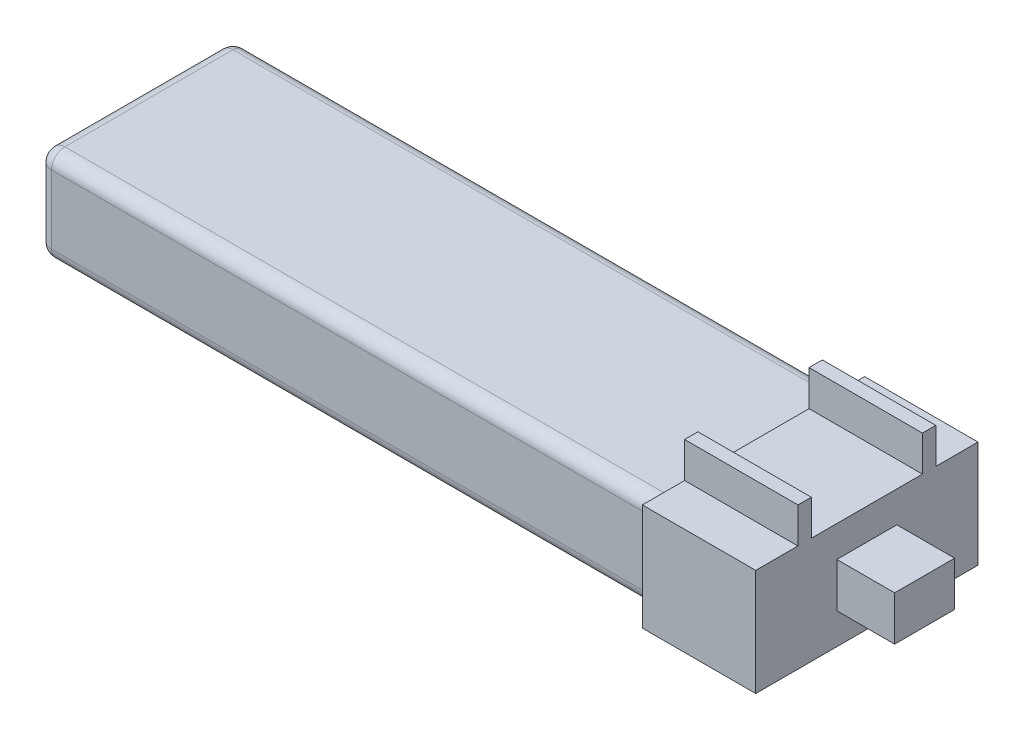
ISO-10303-21;
HEADER;
FILE_DESCRIPTION(('STEP AP214'),'2;1');
FILE_NAME('part.step','',(''),(''),'','','');
FILE_SCHEMA(('AUTOMOTIVE_DESIGN { 1 0 10303 214 1 1 1 1 }'));
ENDSEC;
DATA;
#1=APPLICATION_CONTEXT('core data for automotive mechanical design processes');
#2=APPLICATION_PROTOCOL_DEFINITION('international standard','automotive_design',2000,#1);
#3=PRODUCT_CONTEXT('',#1,'mechanical');
#4=PRODUCT('Part','Part','',(#3));
#5=PRODUCT_RELATED_PRODUCT_CATEGORY('part','',(#4));
#6=PRODUCT_DEFINITION_FORMATION('','',#4);
#7=PRODUCT_DEFINITION_CONTEXT('part definition',#1,'design');
#8=PRODUCT_DEFINITION('design','',#6,#7);
#9=PRODUCT_DEFINITION_SHAPE('','',#8);
#10=(LENGTH_UNIT() NAMED_UNIT(*) SI_UNIT(.MILLI.,.METRE.));
#11=(NAMED_UNIT(*) PLANE_ANGLE_UNIT() SI_UNIT($,.RADIAN.));
#12=(NAMED_UNIT(*) SI_UNIT($,.STERADIAN.) SOLID_ANGLE_UNIT());
#13=UNCERTAINTY_MEASURE_WITH_UNIT(LENGTH_MEASURE(1.E-05),#10,'distance_accuracy_value','');
#14=(GEOMETRIC_REPRESENTATION_CONTEXT(3) GLOBAL_UNCERTAINTY_ASSIGNED_CONTEXT((#13)) GLOBAL_UNIT_ASSIGNED_CONTEXT((#10,
#11,#12)) REPRESENTATION_CONTEXT('',''));
#15=CARTESIAN_POINT('',(0.,0.,0.));
#16=DIRECTION('',(0.,0.,1.));
#17=DIRECTION('',(1.,0.,0.));
#18=AXIS2_PLACEMENT_3D('',#15,#16,#17);
#19=CARTESIAN_POINT('',(0.,3.048,0.));
#20=DIRECTION('',(0.,-1.,0.));
#21=DIRECTION('',(0.,0.,-1.));
#22=AXIS2_PLACEMENT_3D('',#19,#20,#21);
#23=PLANE('',#22);
#24=DIRECTION('',(0.,0.,1.));
#25=VECTOR('',#24,1.);
#26=CARTESIAN_POINT('',(20.828,3.048,-6.35));
#27=LINE('',#26,#25);
#28=CARTESIAN_POINT('',(20.828,3.048,-6.35));
#29=VERTEX_POINT('',#28);
#30=CARTESIAN_POINT('',(20.828,3.048,-3.937));
#31=VERTEX_POINT('',#30);
#32=EDGE_CURVE('E497',#29,#31,#27,.T.);
#33=ORIENTED_EDGE('',*,*,#32,.F.);
#34=DIRECTION('',(-1.,0.,0.));
#35=VECTOR('',#34,1.);
#36=CARTESIAN_POINT('',(-20.955,3.048,-6.35));
#37=LINE('',#36,#35);
#38=CARTESIAN_POINT('',(14.351,3.048,-6.35));
#39=VERTEX_POINT('',#38);
#40=EDGE_CURVE('E263',#29,#39,#37,.T.);
#41=ORIENTED_EDGE('',*,*,#40,.T.);
#42=DIRECTION('',(0.,0.,1.));
#43=VECTOR('',#42,1.);
#44=CARTESIAN_POINT('',(14.351,3.048,0.));
#45=LINE('',#44,#43);
#46=CARTESIAN_POINT('',(14.351,3.048,-3.937));
#47=VERTEX_POINT('',#46);
#48=EDGE_CURVE('E401',#39,#47,#45,.T.);
#49=ORIENTED_EDGE('',*,*,#48,.T.);
#50=DIRECTION('',(1.,0.,0.));
#51=VECTOR('',#50,1.);
#52=CARTESIAN_POINT('',(14.351,3.048,-3.937));
#53=LINE('',#52,#51);
#54=EDGE_CURVE('E416',#47,#31,#53,.T.);
#55=ORIENTED_EDGE('',*,*,#54,.T.);
#56=EDGE_LOOP('',(#33,#41,#49,#55));
#57=FACE_BOUND('',#56,.T.);
#58=ADVANCED_FACE('F51',(#57),#23,.F.);
#59=DIRECTION('',(0.,0.,1.));
#60=VECTOR('',#59,1.);
#61=CARTESIAN_POINT('',(20.828,3.048,-3.175));
#62=LINE('',#61,#60);
#63=CARTESIAN_POINT('',(20.828,3.048,-3.175));
#64=VERTEX_POINT('',#63);
#65=CARTESIAN_POINT('',(20.828,3.048,3.175));
#66=VERTEX_POINT('',#65);
#67=EDGE_CURVE('E485',#64,#66,#62,.T.);
#68=ORIENTED_EDGE('',*,*,#67,.F.);
#69=DIRECTION('',(1.,0.,0.));
#70=VECTOR('',#69,1.);
#71=CARTESIAN_POINT('',(14.351,3.048,-3.175));
#72=LINE('',#71,#70);
#73=CARTESIAN_POINT('',(14.351,3.048,-3.175));
#74=VERTEX_POINT('',#73);
#75=EDGE_CURVE('E412',#74,#64,#72,.T.);
#76=ORIENTED_EDGE('',*,*,#75,.F.);
#77=CARTESIAN_POINT('',(14.351,3.048,3.175));
#78=VERTEX_POINT('',#77);
#79=EDGE_CURVE('E420',#74,#78,#45,.T.);
#80=ORIENTED_EDGE('',*,*,#79,.T.);
#81=DIRECTION('',(1.,0.,0.));
#82=VECTOR('',#81,1.);
#83=CARTESIAN_POINT('',(14.351,3.048,3.175));
#84=LINE('',#83,#82);
#85=EDGE_CURVE('E441',#78,#66,#84,.T.);
#86=ORIENTED_EDGE('',*,*,#85,.T.);
#87=EDGE_LOOP('',(#68,#76,#80,#86));
#88=FACE_BOUND('',#87,.T.);
#89=ADVANCED_FACE('F545',(#88),#23,.F.);
#90=DIRECTION('',(0.,0.,1.));
#91=VECTOR('',#90,1.);
#92=CARTESIAN_POINT('',(20.828,3.048,3.937));
#93=LINE('',#92,#91);
#94=CARTESIAN_POINT('',(20.828,3.048,3.937));
#95=VERTEX_POINT('',#94);
#96=CARTESIAN_POINT('',(20.828,3.048,6.35));
#97=VERTEX_POINT('',#96);
#98=EDGE_CURVE('E11',#95,#97,#93,.T.);
#99=ORIENTED_EDGE('',*,*,#98,.F.);
#100=DIRECTION('',(1.,0.,0.));
#101=VECTOR('',#100,1.);
#102=CARTESIAN_POINT('',(14.351,3.048,3.937));
#103=LINE('',#102,#101);
#104=CARTESIAN_POINT('',(14.351,3.048,3.937));
#105=VERTEX_POINT('',#104);
#106=EDGE_CURVE('E432',#105,#95,#103,.T.);
#107=ORIENTED_EDGE('',*,*,#106,.F.);
#108=CARTESIAN_POINT('',(14.351,3.048,6.35));
#109=VERTEX_POINT('',#108);
#110=EDGE_CURVE('E398',#105,#109,#45,.T.);
#111=ORIENTED_EDGE('',*,*,#110,.T.);
#112=DIRECTION('',(1.,0.,0.));
#113=VECTOR('',#112,1.);
#114=CARTESIAN_POINT('',(-20.955,3.048,6.35));
#115=LINE('',#114,#113);
#116=EDGE_CURVE('E394',#109,#97,#115,.T.);
#117=ORIENTED_EDGE('',*,*,#116,.T.);
#118=EDGE_LOOP('',(#99,#107,#111,#117));
#119=FACE_BOUND('',#118,.T.);
#120=ADVANCED_FACE('F526',(#119),#23,.F.);
#121=CARTESIAN_POINT('',(-20.955,3.048,-6.35));
#122=DIRECTION('',(0.,0.,1.));
#123=DIRECTION('',(1.,0.,0.));
#124=AXIS2_PLACEMENT_3D('',#121,#122,#123);
#125=PLANE('',#124);
#126=DIRECTION('',(0.,1.,0.));
#127=VECTOR('',#126,1.);
#128=CARTESIAN_POINT('',(20.828,-3.048,-6.35));
#129=LINE('',#128,#127);
#130=CARTESIAN_POINT('',(20.828,-3.048,-6.35));
#131=VERTEX_POINT('',#130);
#132=EDGE_CURVE('E500',#131,#29,#129,.T.);
#133=ORIENTED_EDGE('',*,*,#132,.F.);
#134=DIRECTION('',(-1.,0.,0.));
#135=VECTOR('',#134,1.);
#136=CARTESIAN_POINT('',(-20.955,-3.048,-6.35));
#137=LINE('',#136,#135);
#138=CARTESIAN_POINT('',(14.351,-3.048,-6.35));
#139=VERTEX_POINT('',#138);
#140=EDGE_CURVE('E390',#131,#139,#137,.T.);
#141=ORIENTED_EDGE('',*,*,#140,.T.);
#142=DIRECTION('',(0.,1.,0.));
#143=VECTOR('',#142,1.);
#144=CARTESIAN_POINT('',(14.351,3.048,-6.35));
#145=LINE('',#144,#143);
#146=EDGE_CURVE('E393',#139,#39,#145,.T.);
#147=ORIENTED_EDGE('',*,*,#146,.T.);
#148=ORIENTED_EDGE('',*,*,#40,.F.);
#149=EDGE_LOOP('',(#133,#141,#147,#148));
#150=FACE_BOUND('',#149,.T.);
#151=ADVANCED_FACE('F580',(#150),#125,.F.);
#152=CARTESIAN_POINT('',(-20.955,3.048,6.35));
#153=DIRECTION('',(0.,0.,-1.));
#154=DIRECTION('',(-1.,0.,0.));
#155=AXIS2_PLACEMENT_3D('',#152,#153,#154);
#156=PLANE('',#155);
#157=DIRECTION('',(0.,-1.,0.));
#158=VECTOR('',#157,1.);
#159=CARTESIAN_POINT('',(20.828,3.048,6.35));
#160=LINE('',#159,#158);
#161=CARTESIAN_POINT('',(20.828,-3.048,6.35));
#162=VERTEX_POINT('',#161);
#163=EDGE_CURVE('E55',#97,#162,#160,.T.);
#164=ORIENTED_EDGE('',*,*,#163,.F.);
#165=ORIENTED_EDGE('',*,*,#116,.F.);
#166=DIRECTION('',(0.,-1.,0.));
#167=VECTOR('',#166,1.);
#168=CARTESIAN_POINT('',(14.351,3.048,6.35));
#169=LINE('',#168,#167);
#170=CARTESIAN_POINT('',(14.351,-3.048,6.35));
#171=VERTEX_POINT('',#170);
#172=EDGE_CURVE('E389',#109,#171,#169,.T.);
#173=ORIENTED_EDGE('',*,*,#172,.T.);
#174=DIRECTION('',(1.,0.,0.));
#175=VECTOR('',#174,1.);
#176=CARTESIAN_POINT('',(-20.955,-3.048,6.35));
#177=LINE('',#176,#175);
#178=EDGE_CURVE('E384',#171,#162,#177,.T.);
#179=ORIENTED_EDGE('',*,*,#178,.T.);
#180=EDGE_LOOP('',(#164,#165,#173,#179));
#181=FACE_BOUND('',#180,.T.);
#182=ADVANCED_FACE('F518',(#181),#156,.F.);
#183=CARTESIAN_POINT('',(0.,-3.048,0.));
#184=DIRECTION('',(0.,-1.,0.));
#185=DIRECTION('',(0.,0.,-1.));
#186=AXIS2_PLACEMENT_3D('',#183,#184,#185);
#187=PLANE('',#186);
#188=ORIENTED_EDGE('',*,*,#140,.F.);
#189=DIRECTION('',(0.,0.,-1.));
#190=VECTOR('',#189,1.);
#191=CARTESIAN_POINT('',(20.828,-3.048,6.35));
#192=LINE('',#191,#190);
#193=EDGE_CURVE('E502',#162,#131,#192,.T.);
#194=ORIENTED_EDGE('',*,*,#193,.F.);
#195=ORIENTED_EDGE('',*,*,#178,.F.);
#196=DIRECTION('',(0.,0.,1.));
#197=VECTOR('',#196,1.);
#198=CARTESIAN_POINT('',(14.351,-3.048,0.));
#199=LINE('',#198,#197);
#200=EDGE_CURVE('E449',#139,#171,#199,.T.);
#201=ORIENTED_EDGE('',*,*,#200,.F.);
#202=EDGE_LOOP('',(#188,#194,#195,#201));
#203=FACE_BOUND('',#202,.T.);
#204=ADVANCED_FACE('F516',(#203),#187,.T.);
#205=CARTESIAN_POINT('',(14.351,0.,-3.937));
#206=DIRECTION('',(0.,0.,-1.));
#207=DIRECTION('',(-1.,0.,0.));
#208=AXIS2_PLACEMENT_3D('',#205,#206,#207);
#209=PLANE('',#208);
#210=DIRECTION('',(1.,0.,0.));
#211=VECTOR('',#210,1.);
#212=CARTESIAN_POINT('',(14.351,5.08,-3.937));
#213=LINE('',#212,#211);
#214=CARTESIAN_POINT('',(14.351,5.08,-3.937));
#215=VERTEX_POINT('',#214);
#216=CARTESIAN_POINT('',(20.828,5.08,-3.937));
#217=VERTEX_POINT('',#216);
#218=EDGE_CURVE('E388',#215,#217,#213,.T.);
#219=ORIENTED_EDGE('',*,*,#218,.T.);
#220=DIRECTION('',(0.,1.,0.));
#221=VECTOR('',#220,1.);
#222=CARTESIAN_POINT('',(20.828,3.048,-3.937));
#223=LINE('',#222,#221);
#224=EDGE_CURVE('E494',#31,#217,#223,.T.);
#225=ORIENTED_EDGE('',*,*,#224,.F.);
#226=ORIENTED_EDGE('',*,*,#54,.F.);
#227=DIRECTION('',(0.,1.,0.));
#228=VECTOR('',#227,1.);
#229=CARTESIAN_POINT('',(14.351,0.,-3.937));
#230=LINE('',#229,#228);
#231=EDGE_CURVE('E405',#47,#215,#230,.T.);
#232=ORIENTED_EDGE('',*,*,#231,.T.);
#233=EDGE_LOOP('',(#219,#225,#226,#232));
#234=FACE_BOUND('',#233,.T.);
#235=ADVANCED_FACE('F557',(#234),#209,.T.);
#236=CARTESIAN_POINT('',(14.351,0.,-3.175));
#237=DIRECTION('',(0.,0.,1.));
#238=DIRECTION('',(0.,-1.,0.));
#239=AXIS2_PLACEMENT_3D('',#236,#237,#238);
#240=PLANE('',#239);
#241=ORIENTED_EDGE('',*,*,#75,.T.);
#242=DIRECTION('',(0.,-1.,0.));
#243=VECTOR('',#242,1.);
#244=CARTESIAN_POINT('',(20.828,5.08,-3.175));
#245=LINE('',#244,#243);
#246=CARTESIAN_POINT('',(20.828,5.08,-3.175));
#247=VERTEX_POINT('',#246);
#248=EDGE_CURVE('E488',#247,#64,#245,.T.);
#249=ORIENTED_EDGE('',*,*,#248,.F.);
#250=DIRECTION('',(1.,0.,0.));
#251=VECTOR('',#250,1.);
#252=CARTESIAN_POINT('',(14.351,5.08,-3.175));
#253=LINE('',#252,#251);
#254=CARTESIAN_POINT('',(14.351,5.08,-3.175));
#255=VERTEX_POINT('',#254);
#256=EDGE_CURVE('E406',#255,#247,#253,.T.);
#257=ORIENTED_EDGE('',*,*,#256,.F.);
#258=DIRECTION('',(0.,-1.,0.));
#259=VECTOR('',#258,1.);
#260=CARTESIAN_POINT('',(14.351,0.,-3.175));
#261=LINE('',#260,#259);
#262=EDGE_CURVE('E411',#255,#74,#261,.T.);
#263=ORIENTED_EDGE('',*,*,#262,.T.);
#264=EDGE_LOOP('',(#241,#249,#257,#263));
#265=FACE_BOUND('',#264,.T.);
#266=ADVANCED_FACE('F565',(#265),#240,.T.);
#267=CARTESIAN_POINT('',(14.351,5.08,0.));
#268=DIRECTION('',(0.,1.,0.));
#269=DIRECTION('',(0.,0.,1.));
#270=AXIS2_PLACEMENT_3D('',#267,#268,#269);
#271=PLANE('',#270);
#272=ORIENTED_EDGE('',*,*,#256,.T.);
#273=DIRECTION('',(0.,0.,1.));
#274=VECTOR('',#273,1.);
#275=CARTESIAN_POINT('',(20.828,5.08,-3.937));
#276=LINE('',#275,#274);
#277=EDGE_CURVE('E491',#217,#247,#276,.T.);
#278=ORIENTED_EDGE('',*,*,#277,.F.);
#279=ORIENTED_EDGE('',*,*,#218,.F.);
#280=DIRECTION('',(0.,0.,1.));
#281=VECTOR('',#280,1.);
#282=CARTESIAN_POINT('',(14.351,5.08,0.));
#283=LINE('',#282,#281);
#284=EDGE_CURVE('E410',#215,#255,#283,.T.);
#285=ORIENTED_EDGE('',*,*,#284,.T.);
#286=EDGE_LOOP('',(#272,#278,#279,#285));
#287=FACE_BOUND('',#286,.T.);
#288=ADVANCED_FACE('F561',(#287),#271,.T.);
#289=CARTESIAN_POINT('',(14.351,0.,3.175));
#290=DIRECTION('',(0.,0.,1.));
#291=DIRECTION('',(0.,-1.,0.));
#292=AXIS2_PLACEMENT_3D('',#289,#290,#291);
#293=PLANE('',#292);
#294=DIRECTION('',(0.,1.,0.));
#295=VECTOR('',#294,1.);
#296=CARTESIAN_POINT('',(20.828,3.048,3.175));
#297=LINE('',#296,#295);
#298=CARTESIAN_POINT('',(20.828,5.08,3.175));
#299=VERTEX_POINT('',#298);
#300=EDGE_CURVE('E482',#66,#299,#297,.T.);
#301=ORIENTED_EDGE('',*,*,#300,.F.);
#302=ORIENTED_EDGE('',*,*,#85,.F.);
#303=DIRECTION('',(0.,-1.,0.));
#304=VECTOR('',#303,1.);
#305=CARTESIAN_POINT('',(14.351,0.,3.175));
#306=LINE('',#305,#304);
#307=CARTESIAN_POINT('',(14.351,5.08,3.175));
#308=VERTEX_POINT('',#307);
#309=EDGE_CURVE('E437',#308,#78,#306,.T.);
#310=ORIENTED_EDGE('',*,*,#309,.F.);
#311=DIRECTION('',(1.,0.,0.));
#312=VECTOR('',#311,1.);
#313=CARTESIAN_POINT('',(14.351,5.08,3.175));
#314=LINE('',#313,#312);
#315=EDGE_CURVE('E426',#308,#299,#314,.T.);
#316=ORIENTED_EDGE('',*,*,#315,.T.);
#317=EDGE_LOOP('',(#301,#302,#310,#316));
#318=FACE_BOUND('',#317,.T.);
#319=ADVANCED_FACE('F542',(#318),#293,.F.);
#320=CARTESIAN_POINT('',(14.351,0.,3.937));
#321=DIRECTION('',(0.,0.,-1.));
#322=DIRECTION('',(-1.,0.,0.));
#323=AXIS2_PLACEMENT_3D('',#320,#321,#322);
#324=PLANE('',#323);
#325=DIRECTION('',(0.,-1.,0.));
#326=VECTOR('',#325,1.);
#327=CARTESIAN_POINT('',(20.828,5.08,3.937));
#328=LINE('',#327,#326);
#329=CARTESIAN_POINT('',(20.828,5.08,3.937));
#330=VERTEX_POINT('',#329);
#331=EDGE_CURVE('E61',#330,#95,#328,.T.);
#332=ORIENTED_EDGE('',*,*,#331,.F.);
#333=DIRECTION('',(1.,0.,0.));
#334=VECTOR('',#333,1.);
#335=CARTESIAN_POINT('',(14.351,5.08,3.937));
#336=LINE('',#335,#334);
#337=CARTESIAN_POINT('',(14.351,5.08,3.937));
#338=VERTEX_POINT('',#337);
#339=EDGE_CURVE('E433',#338,#330,#336,.T.);
#340=ORIENTED_EDGE('',*,*,#339,.F.);
#341=DIRECTION('',(0.,1.,0.));
#342=VECTOR('',#341,1.);
#343=CARTESIAN_POINT('',(14.351,0.,3.937));
#344=LINE('',#343,#342);
#345=EDGE_CURVE('E445',#105,#338,#344,.T.);
#346=ORIENTED_EDGE('',*,*,#345,.F.);
#347=ORIENTED_EDGE('',*,*,#106,.T.);
#348=EDGE_LOOP('',(#332,#340,#346,#347));
#349=FACE_BOUND('',#348,.T.);
#350=ADVANCED_FACE('F529',(#349),#324,.F.);
#351=CARTESIAN_POINT('',(14.351,5.08,0.));
#352=DIRECTION('',(0.,-1.,0.));
#353=DIRECTION('',(0.,0.,-1.));
#354=AXIS2_PLACEMENT_3D('',#351,#352,#353);
#355=PLANE('',#354);
#356=DIRECTION('',(0.,0.,1.));
#357=VECTOR('',#356,1.);
#358=CARTESIAN_POINT('',(20.828,5.08,3.175));
#359=LINE('',#358,#357);
#360=EDGE_CURVE('E479',#299,#330,#359,.T.);
#361=ORIENTED_EDGE('',*,*,#360,.F.);
#362=ORIENTED_EDGE('',*,*,#315,.F.);
#363=DIRECTION('',(0.,0.,-1.));
#364=VECTOR('',#363,1.);
#365=CARTESIAN_POINT('',(14.351,5.08,0.));
#366=LINE('',#365,#364);
#367=EDGE_CURVE('E448',#338,#308,#366,.T.);
#368=ORIENTED_EDGE('',*,*,#367,.F.);
#369=ORIENTED_EDGE('',*,*,#339,.T.);
#370=EDGE_LOOP('',(#361,#362,#368,#369));
#371=FACE_BOUND('',#370,.T.);
#372=ADVANCED_FACE('F538',(#371),#355,.F.);
#373=CARTESIAN_POINT('',(14.351,0.,0.));
#374=DIRECTION('',(1.,0.,0.));
#375=DIRECTION('',(0.,0.,-1.));
#376=AXIS2_PLACEMENT_3D('',#373,#374,#375);
#377=PLANE('',#376);
#378=ORIENTED_EDGE('',*,*,#309,.T.);
#379=ORIENTED_EDGE('',*,*,#79,.F.);
#380=ORIENTED_EDGE('',*,*,#262,.F.);
#381=ORIENTED_EDGE('',*,*,#284,.F.);
#382=ORIENTED_EDGE('',*,*,#231,.F.);
#383=ORIENTED_EDGE('',*,*,#48,.F.);
#384=ORIENTED_EDGE('',*,*,#146,.F.);
#385=ORIENTED_EDGE('',*,*,#200,.T.);
#386=ORIENTED_EDGE('',*,*,#172,.F.);
#387=ORIENTED_EDGE('',*,*,#110,.F.);
#388=ORIENTED_EDGE('',*,*,#345,.T.);
#389=ORIENTED_EDGE('',*,*,#367,.T.);
#390=EDGE_LOOP('',(#378,#379,#380,#381,#382,#383,#384,#385,#386,#387,#388,#389));
#391=FACE_BOUND('',#390,.T.);
#392=DIRECTION('',(0.,-1.,0.));
#393=VECTOR('',#392,1.);
#394=CARTESIAN_POINT('',(14.351,0.,5.5626));
#395=LINE('',#394,#393);
#396=CARTESIAN_POINT('',(14.351,1.9558,5.5626));
#397=VERTEX_POINT('',#396);
#398=CARTESIAN_POINT('',(14.351,-1.9558,5.5626));
#399=VERTEX_POINT('',#398);
#400=EDGE_CURVE('E332',#397,#399,#395,.T.);
#401=ORIENTED_EDGE('',*,*,#400,.T.);
#402=CARTESIAN_POINT('',(14.351,-1.9558,4.8006));
#403=DIRECTION('',(1.,0.,0.));
#404=DIRECTION('',(0.,0.,-1.));
#405=AXIS2_PLACEMENT_3D('',#402,#403,#404);
#406=CIRCLE('',#405,0.762);
#407=CARTESIAN_POINT('',(14.351,-2.7178,4.8006));
#408=VERTEX_POINT('',#407);
#409=EDGE_CURVE('E328',#399,#408,#406,.T.);
#410=ORIENTED_EDGE('',*,*,#409,.T.);
#411=DIRECTION('',(0.,0.,-1.));
#412=VECTOR('',#411,1.);
#413=CARTESIAN_POINT('',(14.351,-2.7178,0.));
#414=LINE('',#413,#412);
#415=CARTESIAN_POINT('',(14.351,-2.7178,-4.8006));
#416=VERTEX_POINT('',#415);
#417=EDGE_CURVE('E331',#408,#416,#414,.T.);
#418=ORIENTED_EDGE('',*,*,#417,.T.);
#419=CARTESIAN_POINT('',(14.351,-1.9558,-4.8006));
#420=DIRECTION('',(1.,0.,0.));
#421=DIRECTION('',(0.,0.,-1.));
#422=AXIS2_PLACEMENT_3D('',#419,#420,#421);
#423=CIRCLE('',#422,0.762);
#424=CARTESIAN_POINT('',(14.351,-1.9558,-5.5626));
#425=VERTEX_POINT('',#424);
#426=EDGE_CURVE('E333',#416,#425,#423,.T.);
#427=ORIENTED_EDGE('',*,*,#426,.T.);
#428=DIRECTION('',(0.,1.,0.));
#429=VECTOR('',#428,1.);
#430=CARTESIAN_POINT('',(14.351,0.,-5.5626));
#431=LINE('',#430,#429);
#432=CARTESIAN_POINT('',(14.351,1.9558,-5.5626));
#433=VERTEX_POINT('',#432);
#434=EDGE_CURVE('E327',#425,#433,#431,.T.);
#435=ORIENTED_EDGE('',*,*,#434,.T.);
#436=CARTESIAN_POINT('',(14.351,1.9558,-4.8006));
#437=DIRECTION('',(1.,0.,0.));
#438=DIRECTION('',(0.,0.,-1.));
#439=AXIS2_PLACEMENT_3D('',#436,#437,#438);
#440=CIRCLE('',#439,0.762);
#441=CARTESIAN_POINT('',(14.351,2.7178,-4.8006));
#442=VERTEX_POINT('',#441);
#443=EDGE_CURVE('E324',#433,#442,#440,.T.);
#444=ORIENTED_EDGE('',*,*,#443,.T.);
#445=DIRECTION('',(0.,0.,1.));
#446=VECTOR('',#445,1.);
#447=CARTESIAN_POINT('',(14.351,2.7178,0.));
#448=LINE('',#447,#446);
#449=CARTESIAN_POINT('',(14.351,2.7178,4.8006));
#450=VERTEX_POINT('',#449);
#451=EDGE_CURVE('E323',#442,#450,#448,.T.);
#452=ORIENTED_EDGE('',*,*,#451,.T.);
#453=CARTESIAN_POINT('',(14.351,1.9558,4.8006));
#454=DIRECTION('',(1.,0.,0.));
#455=DIRECTION('',(0.,0.,-1.));
#456=AXIS2_PLACEMENT_3D('',#453,#454,#455);
#457=CIRCLE('',#456,0.762);
#458=EDGE_CURVE('E319',#450,#397,#457,.T.);
#459=ORIENTED_EDGE('',*,*,#458,.T.);
#460=EDGE_LOOP('',(#401,#410,#418,#427,#435,#444,#452,#459));
#461=FACE_BOUND('',#460,.T.);
#462=ADVANCED_FACE('F520',(#391,#461),#377,.F.);
#463=CARTESIAN_POINT('',(-20.955,-2.7178,0.));
#464=DIRECTION('',(0.,-1.,0.));
#465=DIRECTION('',(0.,0.,-1.));
#466=AXIS2_PLACEMENT_3D('',#463,#464,#465);
#467=PLANE('',#466);
#468=DIRECTION('',(0.,0.,-1.));
#469=VECTOR('',#468,1.);
#470=CARTESIAN_POINT('',(-20.193,-2.7178,-5.5626));
#471=LINE('',#470,#469);
#472=CARTESIAN_POINT('',(-20.193,-2.7178,4.8006));
#473=VERTEX_POINT('',#472);
#474=CARTESIAN_POINT('',(-20.193,-2.7178,-4.8006));
#475=VERTEX_POINT('',#474);
#476=EDGE_CURVE('E322',#473,#475,#471,.T.);
#477=ORIENTED_EDGE('',*,*,#476,.T.);
#478=DIRECTION('',(1.,0.,0.));
#479=VECTOR('',#478,1.);
#480=CARTESIAN_POINT('',(-20.955,-2.7178,-4.8006));
#481=LINE('',#480,#479);
#482=EDGE_CURVE('E347',#475,#416,#481,.T.);
#483=ORIENTED_EDGE('',*,*,#482,.T.);
#484=ORIENTED_EDGE('',*,*,#417,.F.);
#485=DIRECTION('',(1.,0.,0.));
#486=VECTOR('',#485,1.);
#487=CARTESIAN_POINT('',(-20.955,-2.7178,4.8006));
#488=LINE('',#487,#486);
#489=EDGE_CURVE('E350',#408,#473,#488,.F.);
#490=ORIENTED_EDGE('',*,*,#489,.T.);
#491=EDGE_LOOP('',(#477,#483,#484,#490));
#492=FACE_BOUND('',#491,.T.);
#493=ADVANCED_FACE('F642',(#492),#467,.T.);
#494=CARTESIAN_POINT('',(-20.955,0.,5.5626));
#495=DIRECTION('',(0.,0.,1.));
#496=DIRECTION('',(1.,0.,0.));
#497=AXIS2_PLACEMENT_3D('',#494,#495,#496);
#498=PLANE('',#497);
#499=DIRECTION('',(0.,-1.,0.));
#500=VECTOR('',#499,1.);
#501=CARTESIAN_POINT('',(-20.193,-2.7178,5.5626));
#502=LINE('',#501,#500);
#503=CARTESIAN_POINT('',(-20.193,1.9558,5.5626));
#504=VERTEX_POINT('',#503);
#505=CARTESIAN_POINT('',(-20.193,-1.9558,5.5626));
#506=VERTEX_POINT('',#505);
#507=EDGE_CURVE('E353',#504,#506,#502,.T.);
#508=ORIENTED_EDGE('',*,*,#507,.T.);
#509=DIRECTION('',(1.,0.,0.));
#510=VECTOR('',#509,1.);
#511=CARTESIAN_POINT('',(-20.955,-1.9558,5.5626));
#512=LINE('',#511,#510);
#513=EDGE_CURVE('E376',#506,#399,#512,.T.);
#514=ORIENTED_EDGE('',*,*,#513,.T.);
#515=ORIENTED_EDGE('',*,*,#400,.F.);
#516=DIRECTION('',(1.,0.,0.));
#517=VECTOR('',#516,1.);
#518=CARTESIAN_POINT('',(-20.955,1.9558,5.5626));
#519=LINE('',#518,#517);
#520=EDGE_CURVE('E340',#397,#504,#519,.F.);
#521=ORIENTED_EDGE('',*,*,#520,.T.);
#522=EDGE_LOOP('',(#508,#514,#515,#521));
#523=FACE_BOUND('',#522,.T.);
#524=ADVANCED_FACE('F651',(#523),#498,.T.);
#525=CARTESIAN_POINT('',(-20.955,2.7178,0.));
#526=DIRECTION('',(0.,1.,0.));
#527=DIRECTION('',(0.,0.,1.));
#528=AXIS2_PLACEMENT_3D('',#525,#526,#527);
#529=PLANE('',#528);
#530=ORIENTED_EDGE('',*,*,#451,.F.);
#531=DIRECTION('',(1.,0.,0.));
#532=VECTOR('',#531,1.);
#533=CARTESIAN_POINT('',(-20.955,2.7178,-4.8006));
#534=LINE('',#533,#532);
#535=CARTESIAN_POINT('',(-20.193,2.7178,-4.8006));
#536=VERTEX_POINT('',#535);
#537=EDGE_CURVE('E336',#442,#536,#534,.F.);
#538=ORIENTED_EDGE('',*,*,#537,.T.);
#539=DIRECTION('',(0.,0.,1.));
#540=VECTOR('',#539,1.);
#541=CARTESIAN_POINT('',(-20.193,2.7178,5.5626));
#542=LINE('',#541,#540);
#543=CARTESIAN_POINT('',(-20.193,2.7178,4.8006));
#544=VERTEX_POINT('',#543);
#545=EDGE_CURVE('E339',#536,#544,#542,.T.);
#546=ORIENTED_EDGE('',*,*,#545,.T.);
#547=DIRECTION('',(1.,0.,0.));
#548=VECTOR('',#547,1.);
#549=CARTESIAN_POINT('',(-20.955,2.7178,4.8006));
#550=LINE('',#549,#548);
#551=EDGE_CURVE('E343',#544,#450,#550,.T.);
#552=ORIENTED_EDGE('',*,*,#551,.T.);
#553=EDGE_LOOP('',(#530,#538,#546,#552));
#554=FACE_BOUND('',#553,.T.);
#555=ADVANCED_FACE('F662',(#554),#529,.T.);
#556=CARTESIAN_POINT('',(-20.955,0.,-5.5626));
#557=DIRECTION('',(0.,0.,-1.));
#558=DIRECTION('',(0.,1.,0.));
#559=AXIS2_PLACEMENT_3D('',#556,#557,#558);
#560=PLANE('',#559);
#561=ORIENTED_EDGE('',*,*,#434,.F.);
#562=DIRECTION('',(1.,0.,0.));
#563=VECTOR('',#562,1.);
#564=CARTESIAN_POINT('',(-20.955,-1.9558,-5.5626));
#565=LINE('',#564,#563);
#566=CARTESIAN_POINT('',(-20.193,-1.9558,-5.5626));
#567=VERTEX_POINT('',#566);
#568=EDGE_CURVE('E346',#425,#567,#565,.F.);
#569=ORIENTED_EDGE('',*,*,#568,.T.);
#570=DIRECTION('',(0.,1.,0.));
#571=VECTOR('',#570,1.);
#572=CARTESIAN_POINT('',(-20.193,2.7178,-5.5626));
#573=LINE('',#572,#571);
#574=CARTESIAN_POINT('',(-20.193,1.9558,-5.5626));
#575=VERTEX_POINT('',#574);
#576=EDGE_CURVE('E358',#567,#575,#573,.T.);
#577=ORIENTED_EDGE('',*,*,#576,.T.);
#578=DIRECTION('',(1.,0.,0.));
#579=VECTOR('',#578,1.);
#580=CARTESIAN_POINT('',(-20.955,1.9558,-5.5626));
#581=LINE('',#580,#579);
#582=EDGE_CURVE('E361',#575,#433,#581,.T.);
#583=ORIENTED_EDGE('',*,*,#582,.T.);
#584=EDGE_LOOP('',(#561,#569,#577,#583));
#585=FACE_BOUND('',#584,.T.);
#586=ADVANCED_FACE('F595',(#585),#560,.T.);
#587=CARTESIAN_POINT('',(-20.955,3.048,6.35));
#588=DIRECTION('',(1.,0.,0.));
#589=DIRECTION('',(0.,0.,-1.));
#590=AXIS2_PLACEMENT_3D('',#587,#588,#589);
#591=PLANE('',#590);
#592=DIRECTION('',(0.,1.,0.));
#593=VECTOR('',#592,1.);
#594=CARTESIAN_POINT('',(-20.955,-2.7178,-4.8006));
#595=LINE('',#594,#593);
#596=CARTESIAN_POINT('',(-20.955,1.9558,-4.8006));
#597=VERTEX_POINT('',#596);
#598=CARTESIAN_POINT('',(-20.955,-1.9558,-4.8006));
#599=VERTEX_POINT('',#598);
#600=EDGE_CURVE('E364',#597,#599,#595,.F.);
#601=ORIENTED_EDGE('',*,*,#600,.T.);
#602=DIRECTION('',(0.,0.,-1.));
#603=VECTOR('',#602,1.);
#604=CARTESIAN_POINT('',(-20.955,-1.9558,5.5626));
#605=LINE('',#604,#603);
#606=CARTESIAN_POINT('',(-20.955,-1.9558,4.8006));
#607=VERTEX_POINT('',#606);
#608=EDGE_CURVE('E365',#599,#607,#605,.F.);
#609=ORIENTED_EDGE('',*,*,#608,.T.);
#610=DIRECTION('',(0.,-1.,0.));
#611=VECTOR('',#610,1.);
#612=CARTESIAN_POINT('',(-20.955,2.7178,4.8006));
#613=LINE('',#612,#611);
#614=CARTESIAN_POINT('',(-20.955,1.9558,4.8006));
#615=VERTEX_POINT('',#614);
#616=EDGE_CURVE('E368',#607,#615,#613,.F.);
#617=ORIENTED_EDGE('',*,*,#616,.T.);
#618=DIRECTION('',(0.,0.,1.));
#619=VECTOR('',#618,1.);
#620=CARTESIAN_POINT('',(-20.955,1.9558,-5.5626));
#621=LINE('',#620,#619);
#622=EDGE_CURVE('E281',#615,#597,#621,.F.);
#623=ORIENTED_EDGE('',*,*,#622,.T.);
#624=EDGE_LOOP('',(#601,#609,#617,#623));
#625=FACE_BOUND('',#624,.T.);
#626=ADVANCED_FACE('F592',(#625),#591,.F.);
#627=CARTESIAN_POINT('',(-20.955,1.9558,-4.8006));
#628=DIRECTION('',(1.,0.,0.));
#629=DIRECTION('',(0.,0.,-1.));
#630=AXIS2_PLACEMENT_3D('',#627,#628,#629);
#631=CYLINDRICAL_SURFACE('',#630,0.762);
#632=ORIENTED_EDGE('',*,*,#443,.F.);
#633=ORIENTED_EDGE('',*,*,#582,.F.);
#634=CARTESIAN_POINT('',(-20.193,1.9558,-4.8006));
#635=DIRECTION('',(-1.,0.,0.));
#636=DIRECTION('',(0.,0.,1.));
#637=AXIS2_PLACEMENT_3D('',#634,#635,#636);
#638=CIRCLE('',#637,0.762);
#639=EDGE_CURVE('E277',#536,#575,#638,.T.);
#640=ORIENTED_EDGE('',*,*,#639,.F.);
#641=ORIENTED_EDGE('',*,*,#537,.F.);
#642=EDGE_LOOP('',(#632,#633,#640,#641));
#643=FACE_BOUND('',#642,.T.);
#644=ADVANCED_FACE('F594',(#643),#631,.T.);
#645=CARTESIAN_POINT('',(-20.955,-1.9558,-4.8006));
#646=DIRECTION('',(1.,0.,0.));
#647=DIRECTION('',(0.,0.,-1.));
#648=AXIS2_PLACEMENT_3D('',#645,#646,#647);
#649=CYLINDRICAL_SURFACE('',#648,0.762);
#650=ORIENTED_EDGE('',*,*,#426,.F.);
#651=ORIENTED_EDGE('',*,*,#482,.F.);
#652=CARTESIAN_POINT('',(-20.193,-1.9558,-4.8006));
#653=DIRECTION('',(-1.,0.,0.));
#654=DIRECTION('',(0.,0.,1.));
#655=AXIS2_PLACEMENT_3D('',#652,#653,#654);
#656=CIRCLE('',#655,0.762);
#657=EDGE_CURVE('E282',#567,#475,#656,.T.);
#658=ORIENTED_EDGE('',*,*,#657,.F.);
#659=ORIENTED_EDGE('',*,*,#568,.F.);
#660=EDGE_LOOP('',(#650,#651,#658,#659));
#661=FACE_BOUND('',#660,.T.);
#662=ADVANCED_FACE('F695',(#661),#649,.T.);
#663=CARTESIAN_POINT('',(-20.193,0.,-4.8006));
#664=DIRECTION('',(0.,-1.,0.));
#665=DIRECTION('',(0.,0.,-1.));
#666=AXIS2_PLACEMENT_3D('',#663,#664,#665);
#667=CYLINDRICAL_SURFACE('',#666,0.762);
#668=CARTESIAN_POINT('',(-20.193,1.9558,-4.8006));
#669=DIRECTION('',(0.,1.,0.));
#670=DIRECTION('',(0.,0.,1.));
#671=AXIS2_PLACEMENT_3D('',#668,#669,#670);
#672=CIRCLE('',#671,0.762);
#673=EDGE_CURVE('E272',#575,#597,#672,.T.);
#674=ORIENTED_EDGE('',*,*,#673,.F.);
#675=ORIENTED_EDGE('',*,*,#576,.F.);
#676=CARTESIAN_POINT('',(-20.193,-1.9558,-4.8006));
#677=DIRECTION('',(0.,-1.,0.));
#678=DIRECTION('',(0.,0.,-1.));
#679=AXIS2_PLACEMENT_3D('',#676,#677,#678);
#680=CIRCLE('',#679,0.762);
#681=EDGE_CURVE('E276',#599,#567,#680,.T.);
#682=ORIENTED_EDGE('',*,*,#681,.F.);
#683=ORIENTED_EDGE('',*,*,#600,.F.);
#684=EDGE_LOOP('',(#674,#675,#682,#683));
#685=FACE_BOUND('',#684,.T.);
#686=ADVANCED_FACE('F704',(#685),#667,.T.);
#687=CARTESIAN_POINT('',(-20.193,1.9558,-4.8006));
#688=DIRECTION('',(0.,0.,-1.));
#689=DIRECTION('',(0.,1.,0.));
#690=AXIS2_PLACEMENT_3D('',#687,#688,#689);
#691=SPHERICAL_SURFACE('',#690,0.762);
#692=ORIENTED_EDGE('',*,*,#639,.T.);
#693=ORIENTED_EDGE('',*,*,#673,.T.);
#694=CARTESIAN_POINT('',(-20.193,1.9558,-4.8006));
#695=DIRECTION('',(0.,0.,-1.));
#696=DIRECTION('',(-1.,0.,0.));
#697=AXIS2_PLACEMENT_3D('',#694,#695,#696);
#698=CIRCLE('',#697,0.762);
#699=EDGE_CURVE('E286',#536,#597,#698,.F.);
#700=ORIENTED_EDGE('',*,*,#699,.F.);
#701=EDGE_LOOP('',(#692,#693,#700));
#702=FACE_BOUND('',#701,.T.);
#703=ADVANCED_FACE('F714',(#702),#691,.T.);
#704=CARTESIAN_POINT('',(-20.193,-1.9558,-4.8006));
#705=DIRECTION('',(0.,0.,-1.));
#706=DIRECTION('',(-1.,0.,0.));
#707=AXIS2_PLACEMENT_3D('',#704,#705,#706);
#708=SPHERICAL_SURFACE('',#707,0.762);
#709=ORIENTED_EDGE('',*,*,#681,.T.);
#710=ORIENTED_EDGE('',*,*,#657,.T.);
#711=CARTESIAN_POINT('',(-20.193,-1.9558,-4.8006));
#712=DIRECTION('',(0.,0.,-1.));
#713=DIRECTION('',(-1.,0.,0.));
#714=AXIS2_PLACEMENT_3D('',#711,#712,#713);
#715=CIRCLE('',#714,0.762);
#716=EDGE_CURVE('E293',#599,#475,#715,.F.);
#717=ORIENTED_EDGE('',*,*,#716,.F.);
#718=EDGE_LOOP('',(#709,#710,#717));
#719=FACE_BOUND('',#718,.T.);
#720=ADVANCED_FACE('F724',(#719),#708,.T.);
#721=CARTESIAN_POINT('',(-20.193,1.9558,0.));
#722=DIRECTION('',(0.,0.,-1.));
#723=DIRECTION('',(0.,1.,0.));
#724=AXIS2_PLACEMENT_3D('',#721,#722,#723);
#725=CYLINDRICAL_SURFACE('',#724,0.762);
#726=ORIENTED_EDGE('',*,*,#699,.T.);
#727=ORIENTED_EDGE('',*,*,#622,.F.);
#728=CARTESIAN_POINT('',(-20.193,1.9558,4.8006));
#729=DIRECTION('',(0.,0.,1.));
#730=DIRECTION('',(1.,0.,0.));
#731=AXIS2_PLACEMENT_3D('',#728,#729,#730);
#732=CIRCLE('',#731,0.762);
#733=EDGE_CURVE('E298',#544,#615,#732,.T.);
#734=ORIENTED_EDGE('',*,*,#733,.F.);
#735=ORIENTED_EDGE('',*,*,#545,.F.);
#736=EDGE_LOOP('',(#726,#727,#734,#735));
#737=FACE_BOUND('',#736,.T.);
#738=ADVANCED_FACE('F734',(#737),#725,.T.);
#739=CARTESIAN_POINT('',(-20.955,1.9558,4.8006));
#740=DIRECTION('',(1.,0.,0.));
#741=DIRECTION('',(0.,0.,-1.));
#742=AXIS2_PLACEMENT_3D('',#739,#740,#741);
#743=CYLINDRICAL_SURFACE('',#742,0.762);
#744=ORIENTED_EDGE('',*,*,#458,.F.);
#745=ORIENTED_EDGE('',*,*,#551,.F.);
#746=CARTESIAN_POINT('',(-20.193,1.9558,4.8006));
#747=DIRECTION('',(-1.,0.,0.));
#748=DIRECTION('',(0.,0.,1.));
#749=AXIS2_PLACEMENT_3D('',#746,#747,#748);
#750=CIRCLE('',#749,0.762);
#751=EDGE_CURVE('E297',#504,#544,#750,.T.);
#752=ORIENTED_EDGE('',*,*,#751,.F.);
#753=ORIENTED_EDGE('',*,*,#520,.F.);
#754=EDGE_LOOP('',(#744,#745,#752,#753));
#755=FACE_BOUND('',#754,.T.);
#756=ADVANCED_FACE('F744',(#755),#743,.T.);
#757=CARTESIAN_POINT('',(-20.955,-1.9558,4.8006));
#758=DIRECTION('',(1.,0.,0.));
#759=DIRECTION('',(0.,0.,-1.));
#760=AXIS2_PLACEMENT_3D('',#757,#758,#759);
#761=CYLINDRICAL_SURFACE('',#760,0.762);
#762=ORIENTED_EDGE('',*,*,#409,.F.);
#763=ORIENTED_EDGE('',*,*,#513,.F.);
#764=CARTESIAN_POINT('',(-20.193,-1.9558,4.8006));
#765=DIRECTION('',(-1.,0.,0.));
#766=DIRECTION('',(0.,0.,1.));
#767=AXIS2_PLACEMENT_3D('',#764,#765,#766);
#768=CIRCLE('',#767,0.762);
#769=EDGE_CURVE('E306',#473,#506,#768,.T.);
#770=ORIENTED_EDGE('',*,*,#769,.F.);
#771=ORIENTED_EDGE('',*,*,#489,.F.);
#772=EDGE_LOOP('',(#762,#763,#770,#771));
#773=FACE_BOUND('',#772,.T.);
#774=ADVANCED_FACE('F754',(#773),#761,.T.);
#775=CARTESIAN_POINT('',(-20.193,-1.9558,0.));
#776=DIRECTION('',(0.,0.,1.));
#777=DIRECTION('',(0.,-1.,0.));
#778=AXIS2_PLACEMENT_3D('',#775,#776,#777);
#779=CYLINDRICAL_SURFACE('',#778,0.762);
#780=ORIENTED_EDGE('',*,*,#716,.T.);
#781=ORIENTED_EDGE('',*,*,#476,.F.);
#782=CARTESIAN_POINT('',(-20.193,-1.9558,4.8006));
#783=DIRECTION('',(0.,0.,1.));
#784=DIRECTION('',(1.,0.,0.));
#785=AXIS2_PLACEMENT_3D('',#782,#783,#784);
#786=CIRCLE('',#785,0.762);
#787=EDGE_CURVE('E302',#607,#473,#786,.T.);
#788=ORIENTED_EDGE('',*,*,#787,.F.);
#789=ORIENTED_EDGE('',*,*,#608,.F.);
#790=EDGE_LOOP('',(#780,#781,#788,#789));
#791=FACE_BOUND('',#790,.T.);
#792=ADVANCED_FACE('F764',(#791),#779,.T.);
#793=CARTESIAN_POINT('',(-20.193,1.9558,4.8006));
#794=DIRECTION('',(0.,1.,0.));
#795=DIRECTION('',(0.,0.,1.));
#796=AXIS2_PLACEMENT_3D('',#793,#794,#795);
#797=SPHERICAL_SURFACE('',#796,0.762);
#798=ORIENTED_EDGE('',*,*,#751,.T.);
#799=ORIENTED_EDGE('',*,*,#733,.T.);
#800=CARTESIAN_POINT('',(-20.193,1.9558,4.8006));
#801=DIRECTION('',(0.,1.,0.));
#802=DIRECTION('',(0.,0.,1.));
#803=AXIS2_PLACEMENT_3D('',#800,#801,#802);
#804=CIRCLE('',#803,0.762);
#805=EDGE_CURVE('E310',#504,#615,#804,.F.);
#806=ORIENTED_EDGE('',*,*,#805,.F.);
#807=EDGE_LOOP('',(#798,#799,#806));
#808=FACE_BOUND('',#807,.T.);
#809=ADVANCED_FACE('F774',(#808),#797,.T.);
#810=CARTESIAN_POINT('',(-20.193,-1.9558,4.8006));
#811=DIRECTION('',(0.,-1.,0.));
#812=DIRECTION('',(0.,0.,-1.));
#813=AXIS2_PLACEMENT_3D('',#810,#811,#812);
#814=SPHERICAL_SURFACE('',#813,0.762);
#815=ORIENTED_EDGE('',*,*,#787,.T.);
#816=ORIENTED_EDGE('',*,*,#769,.T.);
#817=CARTESIAN_POINT('',(-20.193,-1.9558,4.8006));
#818=DIRECTION('',(0.,-1.,0.));
#819=DIRECTION('',(1.,0.,0.));
#820=AXIS2_PLACEMENT_3D('',#817,#818,#819);
#821=CIRCLE('',#820,0.762);
#822=EDGE_CURVE('E316',#607,#506,#821,.F.);
#823=ORIENTED_EDGE('',*,*,#822,.F.);
#824=EDGE_LOOP('',(#815,#816,#823));
#825=FACE_BOUND('',#824,.T.);
#826=ADVANCED_FACE('F784',(#825),#814,.T.);
#827=CARTESIAN_POINT('',(-20.193,0.,4.8006));
#828=DIRECTION('',(0.,1.,0.));
#829=DIRECTION('',(0.,0.,1.));
#830=AXIS2_PLACEMENT_3D('',#827,#828,#829);
#831=CYLINDRICAL_SURFACE('',#830,0.762);
#832=ORIENTED_EDGE('',*,*,#805,.T.);
#833=ORIENTED_EDGE('',*,*,#616,.F.);
#834=ORIENTED_EDGE('',*,*,#822,.T.);
#835=ORIENTED_EDGE('',*,*,#507,.F.);
#836=EDGE_LOOP('',(#832,#833,#834,#835));
#837=FACE_BOUND('',#836,.T.);
#838=ADVANCED_FACE('F590',(#837),#831,.T.);
#839=CARTESIAN_POINT('',(20.828,0.,0.));
#840=DIRECTION('',(1.,0.,0.));
#841=DIRECTION('',(0.,0.,-1.));
#842=AXIS2_PLACEMENT_3D('',#839,#840,#841);
#843=PLANE('',#842);
#844=DIRECTION('',(0.,-1.,0.));
#845=VECTOR('',#844,1.);
#846=CARTESIAN_POINT('',(20.828,-1.27,1.7145));
#847=LINE('',#846,#845);
#848=CARTESIAN_POINT('',(20.828,1.27,1.7145));
#849=VERTEX_POINT('',#848);
#850=CARTESIAN_POINT('',(20.828,-1.27,1.7145));
#851=VERTEX_POINT('',#850);
#852=EDGE_CURVE('E69',#849,#851,#847,.T.);
#853=ORIENTED_EDGE('',*,*,#852,.F.);
#854=DIRECTION('',(0.,0.,1.));
#855=VECTOR('',#854,1.);
#856=CARTESIAN_POINT('',(20.828,1.27,1.7145));
#857=LINE('',#856,#855);
#858=CARTESIAN_POINT('',(20.828,1.27,-1.7145));
#859=VERTEX_POINT('',#858);
#860=EDGE_CURVE('E74',#859,#849,#857,.T.);
#861=ORIENTED_EDGE('',*,*,#860,.F.);
#862=DIRECTION('',(0.,1.,0.));
#863=VECTOR('',#862,1.);
#864=CARTESIAN_POINT('',(20.828,1.27,-1.7145));
#865=LINE('',#864,#863);
#866=CARTESIAN_POINT('',(20.828,-1.27,-1.7145));
#867=VERTEX_POINT('',#866);
#868=EDGE_CURVE('E234',#867,#859,#865,.T.);
#869=ORIENTED_EDGE('',*,*,#868,.F.);
#870=DIRECTION('',(0.,0.,-1.));
#871=VECTOR('',#870,1.);
#872=CARTESIAN_POINT('',(20.828,-1.27,-1.7145));
#873=LINE('',#872,#871);
#874=EDGE_CURVE('E261',#851,#867,#873,.T.);
#875=ORIENTED_EDGE('',*,*,#874,.F.);
#876=EDGE_LOOP('',(#853,#861,#869,#875));
#877=FACE_BOUND('',#876,.T.);
#878=ORIENTED_EDGE('',*,*,#163,.T.);
#879=ORIENTED_EDGE('',*,*,#193,.T.);
#880=ORIENTED_EDGE('',*,*,#132,.T.);
#881=ORIENTED_EDGE('',*,*,#32,.T.);
#882=ORIENTED_EDGE('',*,*,#224,.T.);
#883=ORIENTED_EDGE('',*,*,#277,.T.);
#884=ORIENTED_EDGE('',*,*,#248,.T.);
#885=ORIENTED_EDGE('',*,*,#67,.T.);
#886=ORIENTED_EDGE('',*,*,#300,.T.);
#887=ORIENTED_EDGE('',*,*,#360,.T.);
#888=ORIENTED_EDGE('',*,*,#331,.T.);
#889=ORIENTED_EDGE('',*,*,#98,.T.);
#890=EDGE_LOOP('',(#878,#879,#880,#881,#882,#883,#884,#885,#886,#887,#888,#889));
#891=FACE_BOUND('',#890,.T.);
#892=ADVANCED_FACE('F53',(#877,#891),#843,.T.);
#893=CARTESIAN_POINT('',(16.5607244054315,1.27,-1.7145));
#894=DIRECTION('',(0.,0.,1.));
#895=DIRECTION('',(0.,-1.,0.));
#896=AXIS2_PLACEMENT_3D('',#893,#894,#895);
#897=PLANE('',#896);
#898=DIRECTION('',(1.,0.,0.));
#899=VECTOR('',#898,1.);
#900=CARTESIAN_POINT('',(16.5607244054315,-1.27,-1.7145));
#901=LINE('',#900,#899);
#902=CARTESIAN_POINT('',(24.13,-1.27,-1.7145));
#903=VERTEX_POINT('',#902);
#904=EDGE_CURVE('E241',#867,#903,#901,.T.);
#905=ORIENTED_EDGE('',*,*,#904,.F.);
#906=ORIENTED_EDGE('',*,*,#868,.T.);
#907=DIRECTION('',(1.,0.,0.));
#908=VECTOR('',#907,1.);
#909=CARTESIAN_POINT('',(16.5607244054315,1.27,-1.7145));
#910=LINE('',#909,#908);
#911=CARTESIAN_POINT('',(24.13,1.27,-1.7145));
#912=VERTEX_POINT('',#911);
#913=EDGE_CURVE('E266',#859,#912,#910,.T.);
#914=ORIENTED_EDGE('',*,*,#913,.T.);
#915=DIRECTION('',(0.,1.,0.));
#916=VECTOR('',#915,1.);
#917=CARTESIAN_POINT('',(24.13,0.,-1.7145));
#918=LINE('',#917,#916);
#919=EDGE_CURVE('E246',#903,#912,#918,.T.);
#920=ORIENTED_EDGE('',*,*,#919,.F.);
#921=EDGE_LOOP('',(#905,#906,#914,#920));
#922=FACE_BOUND('',#921,.T.);
#923=ADVANCED_FACE('F810',(#922),#897,.F.);
#924=CARTESIAN_POINT('',(16.5607244054315,1.27,1.7145));
#925=DIRECTION('',(0.,-1.,0.));
#926=DIRECTION('',(0.,0.,-1.));
#927=AXIS2_PLACEMENT_3D('',#924,#925,#926);
#928=PLANE('',#927);
#929=ORIENTED_EDGE('',*,*,#913,.F.);
#930=ORIENTED_EDGE('',*,*,#860,.T.);
#931=DIRECTION('',(1.,0.,0.));
#932=VECTOR('',#931,1.);
#933=CARTESIAN_POINT('',(16.5607244054315,1.27,1.7145));
#934=LINE('',#933,#932);
#935=CARTESIAN_POINT('',(24.13,1.27,1.7145));
#936=VERTEX_POINT('',#935);
#937=EDGE_CURVE('E235',#849,#936,#934,.T.);
#938=ORIENTED_EDGE('',*,*,#937,.T.);
#939=DIRECTION('',(0.,0.,-1.));
#940=VECTOR('',#939,1.);
#941=CARTESIAN_POINT('',(24.13,1.27,0.));
#942=LINE('',#941,#940);
#943=EDGE_CURVE('E250',#936,#912,#942,.T.);
#944=ORIENTED_EDGE('',*,*,#943,.T.);
#945=EDGE_LOOP('',(#929,#930,#938,#944));
#946=FACE_BOUND('',#945,.T.);
#947=ADVANCED_FACE('F815',(#946),#928,.F.);
#948=CARTESIAN_POINT('',(16.5607244054315,-1.27,1.7145));
#949=DIRECTION('',(0.,0.,-1.));
#950=DIRECTION('',(-1.,0.,0.));
#951=AXIS2_PLACEMENT_3D('',#948,#949,#950);
#952=PLANE('',#951);
#953=ORIENTED_EDGE('',*,*,#937,.F.);
#954=ORIENTED_EDGE('',*,*,#852,.T.);
#955=DIRECTION('',(1.,0.,0.));
#956=VECTOR('',#955,1.);
#957=CARTESIAN_POINT('',(16.5607244054315,-1.27,1.7145));
#958=LINE('',#957,#956);
#959=CARTESIAN_POINT('',(24.13,-1.27,1.7145));
#960=VERTEX_POINT('',#959);
#961=EDGE_CURVE('E225',#851,#960,#958,.T.);
#962=ORIENTED_EDGE('',*,*,#961,.T.);
#963=DIRECTION('',(0.,1.,0.));
#964=VECTOR('',#963,1.);
#965=CARTESIAN_POINT('',(24.13,0.,1.7145));
#966=LINE('',#965,#964);
#967=EDGE_CURVE('E229',#960,#936,#966,.T.);
#968=ORIENTED_EDGE('',*,*,#967,.T.);
#969=EDGE_LOOP('',(#953,#954,#962,#968));
#970=FACE_BOUND('',#969,.T.);
#971=ADVANCED_FACE('F227',(#970),#952,.F.);
#972=CARTESIAN_POINT('',(16.5607244054315,-1.27,-1.7145));
#973=DIRECTION('',(0.,1.,0.));
#974=DIRECTION('',(0.,0.,1.));
#975=AXIS2_PLACEMENT_3D('',#972,#973,#974);
#976=PLANE('',#975);
#977=ORIENTED_EDGE('',*,*,#961,.F.);
#978=ORIENTED_EDGE('',*,*,#874,.T.);
#979=ORIENTED_EDGE('',*,*,#904,.T.);
#980=DIRECTION('',(0.,0.,-1.));
#981=VECTOR('',#980,1.);
#982=CARTESIAN_POINT('',(24.13,-1.27,0.));
#983=LINE('',#982,#981);
#984=EDGE_CURVE('E238',#960,#903,#983,.T.);
#985=ORIENTED_EDGE('',*,*,#984,.F.);
#986=EDGE_LOOP('',(#977,#978,#979,#985));
#987=FACE_BOUND('',#986,.T.);
#988=ADVANCED_FACE('F239',(#987),#976,.F.);
#989=CARTESIAN_POINT('',(24.13,0.,0.));
#990=DIRECTION('',(1.,0.,0.));
#991=DIRECTION('',(0.,0.,-1.));
#992=AXIS2_PLACEMENT_3D('',#989,#990,#991);
#993=PLANE('',#992);
#994=ORIENTED_EDGE('',*,*,#967,.F.);
#995=ORIENTED_EDGE('',*,*,#984,.T.);
#996=ORIENTED_EDGE('',*,*,#919,.T.);
#997=ORIENTED_EDGE('',*,*,#943,.F.);
#998=EDGE_LOOP('',(#994,#995,#996,#997));
#999=FACE_BOUND('',#998,.T.);
#1000=ADVANCED_FACE('F248',(#999),#993,.T.);
#1001=CLOSED_SHELL('',(#58,#89,#120,#151,#182,#204,#235,#266,#288,#319,#350,#372,#462,#493,#524,
#555,#586,#626,#644,#662,#686,#703,#720,#738,#756,#774,#792,#809,#826,#838,#892,#923,#947,#971,
#988,#1000));
#1002=MANIFOLD_SOLID_BREP('B2',#1001);
#1003=ADVANCED_BREP_SHAPE_REPRESENTATION('',(#18,#1002),#14);
#1004=SHAPE_DEFINITION_REPRESENTATION(#9,#1003);
ENDSEC;
END-ISO-10303-21;
